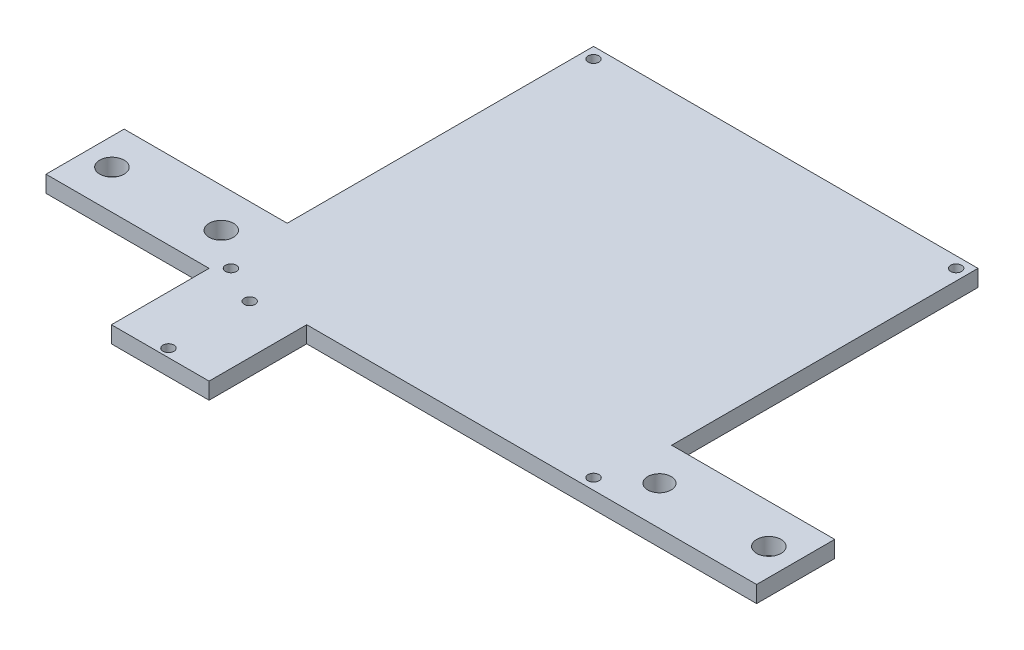
ISO-10303-21;
HEADER;
FILE_DESCRIPTION(('STEP AP214'),'2;1');
FILE_NAME('part.step','',(''),(''),'','','');
FILE_SCHEMA(('AUTOMOTIVE_DESIGN { 1 0 10303 214 1 1 1 1 }'));
ENDSEC;
DATA;
#1=APPLICATION_CONTEXT('core data for automotive mechanical design processes');
#2=APPLICATION_PROTOCOL_DEFINITION('international standard','automotive_design',2000,#1);
#3=PRODUCT_CONTEXT('',#1,'mechanical');
#4=PRODUCT('Part','Part','',(#3));
#5=PRODUCT_RELATED_PRODUCT_CATEGORY('part','',(#4));
#6=PRODUCT_DEFINITION_FORMATION('','',#4);
#7=PRODUCT_DEFINITION_CONTEXT('part definition',#1,'design');
#8=PRODUCT_DEFINITION('design','',#6,#7);
#9=PRODUCT_DEFINITION_SHAPE('','',#8);
#10=(LENGTH_UNIT() NAMED_UNIT(*) SI_UNIT(.MILLI.,.METRE.));
#11=(NAMED_UNIT(*) PLANE_ANGLE_UNIT() SI_UNIT($,.RADIAN.));
#12=(NAMED_UNIT(*) SI_UNIT($,.STERADIAN.) SOLID_ANGLE_UNIT());
#13=UNCERTAINTY_MEASURE_WITH_UNIT(LENGTH_MEASURE(1.E-05),#10,'distance_accuracy_value','');
#14=(GEOMETRIC_REPRESENTATION_CONTEXT(3) GLOBAL_UNCERTAINTY_ASSIGNED_CONTEXT((#13)) GLOBAL_UNIT_ASSIGNED_CONTEXT((#10,
#11,#12)) REPRESENTATION_CONTEXT('',''));
#15=CARTESIAN_POINT('',(0.,0.,0.));
#16=DIRECTION('',(0.,0.,1.));
#17=DIRECTION('',(1.,0.,0.));
#18=AXIS2_PLACEMENT_3D('',#15,#16,#17);
#19=CARTESIAN_POINT('',(0.,4.318,0.));
#20=DIRECTION('',(0.,-1.,0.));
#21=DIRECTION('',(0.,0.,-1.));
#22=AXIS2_PLACEMENT_3D('',#19,#20,#21);
#23=PLANE('',#22);
#24=DIRECTION('',(1.,0.,0.));
#25=VECTOR('',#24,1.);
#26=CARTESIAN_POINT('',(0.,4.318,0.));
#27=LINE('',#26,#25);
#28=CARTESIAN_POINT('',(-42.418,4.318,0.));
#29=VERTEX_POINT('',#28);
#30=CARTESIAN_POINT('',(0.,4.318,0.));
#31=VERTEX_POINT('',#30);
#32=EDGE_CURVE('E178',#29,#31,#27,.T.);
#33=ORIENTED_EDGE('',*,*,#32,.T.);
#34=DIRECTION('',(0.,0.,1.));
#35=VECTOR('',#34,1.);
#36=CARTESIAN_POINT('',(0.,4.318,0.));
#37=LINE('',#36,#35);
#38=CARTESIAN_POINT('',(0.,4.318,25.4));
#39=VERTEX_POINT('',#38);
#40=EDGE_CURVE('E105',#31,#39,#37,.T.);
#41=ORIENTED_EDGE('',*,*,#40,.T.);
#42=DIRECTION('',(1.,0.,0.));
#43=VECTOR('',#42,1.);
#44=CARTESIAN_POINT('',(0.,4.318,25.4));
#45=LINE('',#44,#43);
#46=CARTESIAN_POINT('',(25.4,4.318,25.4));
#47=VERTEX_POINT('',#46);
#48=EDGE_CURVE('E205',#39,#47,#45,.T.);
#49=ORIENTED_EDGE('',*,*,#48,.T.);
#50=DIRECTION('',(0.,0.,-1.));
#51=VECTOR('',#50,1.);
#52=CARTESIAN_POINT('',(25.4,4.318,25.4));
#53=LINE('',#52,#51);
#54=CARTESIAN_POINT('',(25.4,4.318,0.));
#55=VERTEX_POINT('',#54);
#56=EDGE_CURVE('E223',#47,#55,#53,.T.);
#57=ORIENTED_EDGE('',*,*,#56,.T.);
#58=DIRECTION('',(1.,0.,0.));
#59=VECTOR('',#58,1.);
#60=CARTESIAN_POINT('',(25.4,4.318,0.));
#61=LINE('',#60,#59);
#62=CARTESIAN_POINT('',(142.418,4.318,0.));
#63=VERTEX_POINT('',#62);
#64=EDGE_CURVE('E220',#55,#63,#61,.T.);
#65=ORIENTED_EDGE('',*,*,#64,.T.);
#66=DIRECTION('',(0.,0.,-1.));
#67=VECTOR('',#66,1.);
#68=CARTESIAN_POINT('',(142.418,4.318,0.));
#69=LINE('',#68,#67);
#70=CARTESIAN_POINT('',(142.418,4.318,-20.32));
#71=VERTEX_POINT('',#70);
#72=EDGE_CURVE('E222',#63,#71,#69,.T.);
#73=ORIENTED_EDGE('',*,*,#72,.T.);
#74=DIRECTION('',(-1.,0.,0.));
#75=VECTOR('',#74,1.);
#76=CARTESIAN_POINT('',(142.418,4.318,-20.32));
#77=LINE('',#76,#75);
#78=CARTESIAN_POINT('',(100.,4.318,-20.32));
#79=VERTEX_POINT('',#78);
#80=EDGE_CURVE('E225',#71,#79,#77,.T.);
#81=ORIENTED_EDGE('',*,*,#80,.T.);
#82=DIRECTION('',(0.,0.,-1.));
#83=VECTOR('',#82,1.);
#84=CARTESIAN_POINT('',(100.,4.318,-100.));
#85=LINE('',#84,#83);
#86=CARTESIAN_POINT('',(100.,4.318,-100.));
#87=VERTEX_POINT('',#86);
#88=EDGE_CURVE('E231',#79,#87,#85,.T.);
#89=ORIENTED_EDGE('',*,*,#88,.T.);
#90=DIRECTION('',(-1.,0.,0.));
#91=VECTOR('',#90,1.);
#92=CARTESIAN_POINT('',(0.,4.318,-100.));
#93=LINE('',#92,#91);
#94=CARTESIAN_POINT('',(0.,4.318,-100.));
#95=VERTEX_POINT('',#94);
#96=EDGE_CURVE('E136',#87,#95,#93,.T.);
#97=ORIENTED_EDGE('',*,*,#96,.T.);
#98=DIRECTION('',(0.,0.,1.));
#99=VECTOR('',#98,1.);
#100=CARTESIAN_POINT('',(0.,4.318,-20.32));
#101=LINE('',#100,#99);
#102=CARTESIAN_POINT('',(0.,4.318,-20.32));
#103=VERTEX_POINT('',#102);
#104=EDGE_CURVE('E130',#95,#103,#101,.T.);
#105=ORIENTED_EDGE('',*,*,#104,.T.);
#106=DIRECTION('',(-1.,0.,0.));
#107=VECTOR('',#106,1.);
#108=CARTESIAN_POINT('',(-42.418,4.318,-20.32));
#109=LINE('',#108,#107);
#110=CARTESIAN_POINT('',(-42.418,4.318,-20.32));
#111=VERTEX_POINT('',#110);
#112=EDGE_CURVE('E134',#103,#111,#109,.T.);
#113=ORIENTED_EDGE('',*,*,#112,.T.);
#114=DIRECTION('',(0.,0.,1.));
#115=VECTOR('',#114,1.);
#116=CARTESIAN_POINT('',(-42.418,4.318,0.));
#117=LINE('',#116,#115);
#118=EDGE_CURVE('E50',#111,#29,#117,.T.);
#119=ORIENTED_EDGE('',*,*,#118,.T.);
#120=EDGE_LOOP('',(#33,#41,#49,#57,#65,#73,#81,#89,#97,#105,#113,#119));
#121=FACE_BOUND('',#120,.T.);
#122=CARTESIAN_POINT('',(2.84479999999999,4.318,-2.84479999999999));
#123=DIRECTION('',(0.,1.,0.));
#124=DIRECTION('',(0.,0.,1.));
#125=AXIS2_PLACEMENT_3D('',#122,#123,#124);
#126=CIRCLE('',#125,1.4224);
#127=CARTESIAN_POINT('',(2.84479999999999,4.318,-1.42239999999999));
#128=VERTEX_POINT('',#127);
#129=EDGE_CURVE('E158',#128,#128,#126,.T.);
#130=ORIENTED_EDGE('',*,*,#129,.F.);
#131=EDGE_LOOP('',(#130));
#132=FACE_BOUND('',#131,.T.);
#133=CARTESIAN_POINT('',(97.1552,4.318,-2.84479999999999));
#134=DIRECTION('',(0.,1.,0.));
#135=DIRECTION('',(0.,0.,1.));
#136=AXIS2_PLACEMENT_3D('',#133,#134,#135);
#137=CIRCLE('',#136,1.42240000000001);
#138=CARTESIAN_POINT('',(97.1552,4.318,-1.42239999999999));
#139=VERTEX_POINT('',#138);
#140=EDGE_CURVE('E355',#139,#139,#137,.T.);
#141=ORIENTED_EDGE('',*,*,#140,.F.);
#142=EDGE_LOOP('',(#141));
#143=FACE_BOUND('',#142,.T.);
#144=CARTESIAN_POINT('',(2.8448,4.318,-97.1552));
#145=DIRECTION('',(0.,1.,0.));
#146=DIRECTION('',(0.,0.,1.));
#147=AXIS2_PLACEMENT_3D('',#144,#145,#146);
#148=CIRCLE('',#147,1.4224);
#149=CARTESIAN_POINT('',(2.8448,4.318,-95.7328));
#150=VERTEX_POINT('',#149);
#151=EDGE_CURVE('E349',#150,#150,#148,.T.);
#152=ORIENTED_EDGE('',*,*,#151,.F.);
#153=EDGE_LOOP('',(#152));
#154=FACE_BOUND('',#153,.T.);
#155=CARTESIAN_POINT('',(97.1552,4.318,-97.1552));
#156=DIRECTION('',(0.,1.,0.));
#157=DIRECTION('',(0.,0.,1.));
#158=AXIS2_PLACEMENT_3D('',#155,#156,#157);
#159=CIRCLE('',#158,1.42240000000001);
#160=CARTESIAN_POINT('',(97.1552,4.318,-95.7328));
#161=VERTEX_POINT('',#160);
#162=EDGE_CURVE('E343',#161,#161,#159,.T.);
#163=ORIENTED_EDGE('',*,*,#162,.F.);
#164=EDGE_LOOP('',(#163));
#165=FACE_BOUND('',#164,.T.);
#166=CARTESIAN_POINT('',(-6.985,4.318,-10.16));
#167=DIRECTION('',(0.,1.,0.));
#168=DIRECTION('',(0.,0.,1.));
#169=AXIS2_PLACEMENT_3D('',#166,#167,#168);
#170=CIRCLE('',#169,3.175);
#171=CARTESIAN_POINT('',(-6.985,4.318,-6.98499999999999));
#172=VERTEX_POINT('',#171);
#173=EDGE_CURVE('E337',#172,#172,#170,.T.);
#174=ORIENTED_EDGE('',*,*,#173,.F.);
#175=EDGE_LOOP('',(#174));
#176=FACE_BOUND('',#175,.T.);
#177=CARTESIAN_POINT('',(12.7,4.318,23.2664));
#178=DIRECTION('',(0.,1.,0.));
#179=DIRECTION('',(0.,0.,1.));
#180=AXIS2_PLACEMENT_3D('',#177,#178,#179);
#181=CIRCLE('',#180,1.4224);
#182=CARTESIAN_POINT('',(12.7,4.318,24.6888));
#183=VERTEX_POINT('',#182);
#184=EDGE_CURVE('E331',#183,#183,#181,.T.);
#185=ORIENTED_EDGE('',*,*,#184,.F.);
#186=EDGE_LOOP('',(#185));
#187=FACE_BOUND('',#186,.T.);
#188=CARTESIAN_POINT('',(12.7,4.318,2.13360000000001));
#189=DIRECTION('',(0.,1.,0.));
#190=DIRECTION('',(0.,0.,1.));
#191=AXIS2_PLACEMENT_3D('',#188,#189,#190);
#192=CIRCLE('',#191,1.4224);
#193=CARTESIAN_POINT('',(12.7,4.318,3.55600000000001));
#194=VERTEX_POINT('',#193);
#195=EDGE_CURVE('E325',#194,#194,#192,.T.);
#196=ORIENTED_EDGE('',*,*,#195,.F.);
#197=EDGE_LOOP('',(#196));
#198=FACE_BOUND('',#197,.T.);
#199=CARTESIAN_POINT('',(-35.433,4.318,-10.16));
#200=DIRECTION('',(0.,1.,0.));
#201=DIRECTION('',(0.,0.,1.));
#202=AXIS2_PLACEMENT_3D('',#199,#200,#201);
#203=CIRCLE('',#202,3.175);
#204=CARTESIAN_POINT('',(-35.433,4.318,-6.985));
#205=VERTEX_POINT('',#204);
#206=EDGE_CURVE('E319',#205,#205,#203,.T.);
#207=ORIENTED_EDGE('',*,*,#206,.F.);
#208=EDGE_LOOP('',(#207));
#209=FACE_BOUND('',#208,.T.);
#210=CARTESIAN_POINT('',(106.985,4.318,-10.16));
#211=DIRECTION('',(0.,1.,0.));
#212=DIRECTION('',(0.,0.,1.));
#213=AXIS2_PLACEMENT_3D('',#210,#211,#212);
#214=CIRCLE('',#213,3.048);
#215=CARTESIAN_POINT('',(106.985,4.318,-7.112));
#216=VERTEX_POINT('',#215);
#217=EDGE_CURVE('E313',#216,#216,#214,.T.);
#218=ORIENTED_EDGE('',*,*,#217,.F.);
#219=EDGE_LOOP('',(#218));
#220=FACE_BOUND('',#219,.T.);
#221=CARTESIAN_POINT('',(135.433,4.318,-10.16));
#222=DIRECTION('',(0.,1.,0.));
#223=DIRECTION('',(0.,0.,1.));
#224=AXIS2_PLACEMENT_3D('',#221,#222,#223);
#225=CIRCLE('',#224,3.175);
#226=CARTESIAN_POINT('',(135.433,4.318,-6.985));
#227=VERTEX_POINT('',#226);
#228=EDGE_CURVE('E304',#227,#227,#225,.T.);
#229=ORIENTED_EDGE('',*,*,#228,.F.);
#230=EDGE_LOOP('',(#229));
#231=FACE_BOUND('',#230,.T.);
#232=ADVANCED_FACE('F33',(#121,#132,#143,#154,#165,#176,#187,#198,#209,#220,#231),#23,.F.);
#233=CARTESIAN_POINT('',(0.,0.,0.));
#234=DIRECTION('',(0.,-1.,0.));
#235=DIRECTION('',(0.,0.,-1.));
#236=AXIS2_PLACEMENT_3D('',#233,#234,#235);
#237=PLANE('',#236);
#238=CARTESIAN_POINT('',(106.985,0.,-10.16));
#239=DIRECTION('',(0.,1.,0.));
#240=DIRECTION('',(0.,0.,1.));
#241=AXIS2_PLACEMENT_3D('',#238,#239,#240);
#242=CIRCLE('',#241,3.048);
#243=CARTESIAN_POINT('',(106.985,0.,-7.112));
#244=VERTEX_POINT('',#243);
#245=EDGE_CURVE('E310',#244,#244,#242,.T.);
#246=ORIENTED_EDGE('',*,*,#245,.T.);
#247=EDGE_LOOP('',(#246));
#248=FACE_BOUND('',#247,.T.);
#249=CARTESIAN_POINT('',(12.7,0.,2.13360000000001));
#250=DIRECTION('',(0.,1.,0.));
#251=DIRECTION('',(0.,0.,1.));
#252=AXIS2_PLACEMENT_3D('',#249,#250,#251);
#253=CIRCLE('',#252,1.4224);
#254=CARTESIAN_POINT('',(12.7,0.,3.55600000000001));
#255=VERTEX_POINT('',#254);
#256=EDGE_CURVE('E322',#255,#255,#253,.T.);
#257=ORIENTED_EDGE('',*,*,#256,.T.);
#258=EDGE_LOOP('',(#257));
#259=FACE_BOUND('',#258,.T.);
#260=CARTESIAN_POINT('',(-6.985,0.,-10.16));
#261=DIRECTION('',(0.,1.,0.));
#262=DIRECTION('',(0.,0.,1.));
#263=AXIS2_PLACEMENT_3D('',#260,#261,#262);
#264=CIRCLE('',#263,3.175);
#265=CARTESIAN_POINT('',(-6.985,0.,-6.98499999999999));
#266=VERTEX_POINT('',#265);
#267=EDGE_CURVE('E334',#266,#266,#264,.T.);
#268=ORIENTED_EDGE('',*,*,#267,.T.);
#269=EDGE_LOOP('',(#268));
#270=FACE_BOUND('',#269,.T.);
#271=CARTESIAN_POINT('',(2.8448,0.,-97.1552));
#272=DIRECTION('',(0.,1.,0.));
#273=DIRECTION('',(0.,0.,1.));
#274=AXIS2_PLACEMENT_3D('',#271,#272,#273);
#275=CIRCLE('',#274,1.4224);
#276=CARTESIAN_POINT('',(2.8448,0.,-95.7328));
#277=VERTEX_POINT('',#276);
#278=EDGE_CURVE('E346',#277,#277,#275,.T.);
#279=ORIENTED_EDGE('',*,*,#278,.T.);
#280=EDGE_LOOP('',(#279));
#281=FACE_BOUND('',#280,.T.);
#282=CARTESIAN_POINT('',(2.84479999999999,0.,-2.84479999999999));
#283=DIRECTION('',(0.,1.,0.));
#284=DIRECTION('',(0.,0.,1.));
#285=AXIS2_PLACEMENT_3D('',#282,#283,#284);
#286=CIRCLE('',#285,1.4224);
#287=CARTESIAN_POINT('',(2.84479999999999,0.,-1.42239999999999));
#288=VERTEX_POINT('',#287);
#289=EDGE_CURVE('E358',#288,#288,#286,.T.);
#290=ORIENTED_EDGE('',*,*,#289,.T.);
#291=EDGE_LOOP('',(#290));
#292=FACE_BOUND('',#291,.T.);
#293=DIRECTION('',(1.,0.,0.));
#294=VECTOR('',#293,1.);
#295=CARTESIAN_POINT('',(0.,0.,0.));
#296=LINE('',#295,#294);
#297=CARTESIAN_POINT('',(-42.418,0.,0.));
#298=VERTEX_POINT('',#297);
#299=CARTESIAN_POINT('',(0.,0.,0.));
#300=VERTEX_POINT('',#299);
#301=EDGE_CURVE('E154',#298,#300,#296,.T.);
#302=ORIENTED_EDGE('',*,*,#301,.F.);
#303=DIRECTION('',(0.,0.,1.));
#304=VECTOR('',#303,1.);
#305=CARTESIAN_POINT('',(-42.418,0.,0.));
#306=LINE('',#305,#304);
#307=CARTESIAN_POINT('',(-42.418,0.,-20.32));
#308=VERTEX_POINT('',#307);
#309=EDGE_CURVE('E97',#308,#298,#306,.T.);
#310=ORIENTED_EDGE('',*,*,#309,.F.);
#311=DIRECTION('',(-1.,0.,0.));
#312=VECTOR('',#311,1.);
#313=CARTESIAN_POINT('',(-42.418,0.,-20.32));
#314=LINE('',#313,#312);
#315=CARTESIAN_POINT('',(0.,0.,-20.32));
#316=VERTEX_POINT('',#315);
#317=EDGE_CURVE('E91',#316,#308,#314,.T.);
#318=ORIENTED_EDGE('',*,*,#317,.F.);
#319=DIRECTION('',(0.,0.,1.));
#320=VECTOR('',#319,1.);
#321=CARTESIAN_POINT('',(0.,0.,-20.32));
#322=LINE('',#321,#320);
#323=CARTESIAN_POINT('',(0.,0.,-100.));
#324=VERTEX_POINT('',#323);
#325=EDGE_CURVE('E144',#324,#316,#322,.T.);
#326=ORIENTED_EDGE('',*,*,#325,.F.);
#327=DIRECTION('',(-1.,0.,0.));
#328=VECTOR('',#327,1.);
#329=CARTESIAN_POINT('',(0.,0.,-100.));
#330=LINE('',#329,#328);
#331=CARTESIAN_POINT('',(100.,0.,-100.));
#332=VERTEX_POINT('',#331);
#333=EDGE_CURVE('E173',#332,#324,#330,.T.);
#334=ORIENTED_EDGE('',*,*,#333,.F.);
#335=DIRECTION('',(0.,0.,-1.));
#336=VECTOR('',#335,1.);
#337=CARTESIAN_POINT('',(100.,0.,-100.));
#338=LINE('',#337,#336);
#339=CARTESIAN_POINT('',(100.,0.,-20.32));
#340=VERTEX_POINT('',#339);
#341=EDGE_CURVE('E171',#340,#332,#338,.T.);
#342=ORIENTED_EDGE('',*,*,#341,.F.);
#343=DIRECTION('',(-1.,0.,0.));
#344=VECTOR('',#343,1.);
#345=CARTESIAN_POINT('',(142.418,0.,-20.32));
#346=LINE('',#345,#344);
#347=CARTESIAN_POINT('',(142.418,0.,-20.32));
#348=VERTEX_POINT('',#347);
#349=EDGE_CURVE('E169',#348,#340,#346,.T.);
#350=ORIENTED_EDGE('',*,*,#349,.F.);
#351=DIRECTION('',(0.,0.,-1.));
#352=VECTOR('',#351,1.);
#353=CARTESIAN_POINT('',(142.418,0.,0.));
#354=LINE('',#353,#352);
#355=CARTESIAN_POINT('',(142.418,0.,0.));
#356=VERTEX_POINT('',#355);
#357=EDGE_CURVE('E167',#356,#348,#354,.T.);
#358=ORIENTED_EDGE('',*,*,#357,.F.);
#359=DIRECTION('',(1.,0.,0.));
#360=VECTOR('',#359,1.);
#361=CARTESIAN_POINT('',(100.,0.,0.));
#362=LINE('',#361,#360);
#363=CARTESIAN_POINT('',(25.4,0.,0.));
#364=VERTEX_POINT('',#363);
#365=EDGE_CURVE('E165',#364,#356,#362,.T.);
#366=ORIENTED_EDGE('',*,*,#365,.F.);
#367=DIRECTION('',(0.,0.,-1.));
#368=VECTOR('',#367,1.);
#369=CARTESIAN_POINT('',(25.4,0.,25.4));
#370=LINE('',#369,#368);
#371=CARTESIAN_POINT('',(25.4,0.,25.4));
#372=VERTEX_POINT('',#371);
#373=EDGE_CURVE('E162',#372,#364,#370,.T.);
#374=ORIENTED_EDGE('',*,*,#373,.F.);
#375=DIRECTION('',(1.,0.,0.));
#376=VECTOR('',#375,1.);
#377=CARTESIAN_POINT('',(0.,0.,25.4));
#378=LINE('',#377,#376);
#379=CARTESIAN_POINT('',(0.,0.,25.4));
#380=VERTEX_POINT('',#379);
#381=EDGE_CURVE('E160',#380,#372,#378,.T.);
#382=ORIENTED_EDGE('',*,*,#381,.F.);
#383=DIRECTION('',(0.,0.,1.));
#384=VECTOR('',#383,1.);
#385=CARTESIAN_POINT('',(0.,0.,0.));
#386=LINE('',#385,#384);
#387=EDGE_CURVE('E157',#300,#380,#386,.T.);
#388=ORIENTED_EDGE('',*,*,#387,.F.);
#389=EDGE_LOOP('',(#302,#310,#318,#326,#334,#342,#350,#358,#366,#374,#382,#388));
#390=FACE_BOUND('',#389,.T.);
#391=CARTESIAN_POINT('',(97.1552,0.,-2.84479999999999));
#392=DIRECTION('',(0.,1.,0.));
#393=DIRECTION('',(0.,0.,1.));
#394=AXIS2_PLACEMENT_3D('',#391,#392,#393);
#395=CIRCLE('',#394,1.42240000000001);
#396=CARTESIAN_POINT('',(97.1552,0.,-1.42239999999999));
#397=VERTEX_POINT('',#396);
#398=EDGE_CURVE('E352',#397,#397,#395,.T.);
#399=ORIENTED_EDGE('',*,*,#398,.T.);
#400=EDGE_LOOP('',(#399));
#401=FACE_BOUND('',#400,.T.);
#402=CARTESIAN_POINT('',(97.1552,0.,-97.1552));
#403=DIRECTION('',(0.,1.,0.));
#404=DIRECTION('',(0.,0.,1.));
#405=AXIS2_PLACEMENT_3D('',#402,#403,#404);
#406=CIRCLE('',#405,1.42240000000001);
#407=CARTESIAN_POINT('',(97.1552,0.,-95.7328));
#408=VERTEX_POINT('',#407);
#409=EDGE_CURVE('E340',#408,#408,#406,.T.);
#410=ORIENTED_EDGE('',*,*,#409,.T.);
#411=EDGE_LOOP('',(#410));
#412=FACE_BOUND('',#411,.T.);
#413=CARTESIAN_POINT('',(12.7,0.,23.2664));
#414=DIRECTION('',(0.,1.,0.));
#415=DIRECTION('',(0.,0.,1.));
#416=AXIS2_PLACEMENT_3D('',#413,#414,#415);
#417=CIRCLE('',#416,1.4224);
#418=CARTESIAN_POINT('',(12.7,0.,24.6888));
#419=VERTEX_POINT('',#418);
#420=EDGE_CURVE('E328',#419,#419,#417,.T.);
#421=ORIENTED_EDGE('',*,*,#420,.T.);
#422=EDGE_LOOP('',(#421));
#423=FACE_BOUND('',#422,.T.);
#424=CARTESIAN_POINT('',(-35.433,0.,-10.16));
#425=DIRECTION('',(0.,1.,0.));
#426=DIRECTION('',(0.,0.,1.));
#427=AXIS2_PLACEMENT_3D('',#424,#425,#426);
#428=CIRCLE('',#427,3.175);
#429=CARTESIAN_POINT('',(-35.433,0.,-6.985));
#430=VERTEX_POINT('',#429);
#431=EDGE_CURVE('E316',#430,#430,#428,.T.);
#432=ORIENTED_EDGE('',*,*,#431,.T.);
#433=EDGE_LOOP('',(#432));
#434=FACE_BOUND('',#433,.T.);
#435=CARTESIAN_POINT('',(135.433,0.,-10.16));
#436=DIRECTION('',(0.,1.,0.));
#437=DIRECTION('',(0.,0.,1.));
#438=AXIS2_PLACEMENT_3D('',#435,#436,#437);
#439=CIRCLE('',#438,3.175);
#440=CARTESIAN_POINT('',(135.433,0.,-6.985));
#441=VERTEX_POINT('',#440);
#442=EDGE_CURVE('E307',#441,#441,#439,.T.);
#443=ORIENTED_EDGE('',*,*,#442,.T.);
#444=EDGE_LOOP('',(#443));
#445=FACE_BOUND('',#444,.T.);
#446=ADVANCED_FACE('F209',(#248,#259,#270,#281,#292,#390,#401,#412,#423,#434,#445),#237,.T.);
#447=CARTESIAN_POINT('',(0.,4.318,0.));
#448=DIRECTION('',(0.,0.,-1.));
#449=DIRECTION('',(-1.,0.,0.));
#450=AXIS2_PLACEMENT_3D('',#447,#448,#449);
#451=PLANE('',#450);
#452=ORIENTED_EDGE('',*,*,#301,.T.);
#453=DIRECTION('',(0.,-1.,0.));
#454=VECTOR('',#453,1.);
#455=CARTESIAN_POINT('',(0.,4.318,0.));
#456=LINE('',#455,#454);
#457=EDGE_CURVE('E11',#31,#300,#456,.T.);
#458=ORIENTED_EDGE('',*,*,#457,.F.);
#459=ORIENTED_EDGE('',*,*,#32,.F.);
#460=DIRECTION('',(0.,-1.,0.));
#461=VECTOR('',#460,1.);
#462=CARTESIAN_POINT('',(-42.418,4.318,0.));
#463=LINE('',#462,#461);
#464=EDGE_CURVE('E150',#29,#298,#463,.T.);
#465=ORIENTED_EDGE('',*,*,#464,.T.);
#466=EDGE_LOOP('',(#452,#458,#459,#465));
#467=FACE_BOUND('',#466,.T.);
#468=ADVANCED_FACE('F35',(#467),#451,.F.);
#469=CARTESIAN_POINT('',(0.,4.318,0.));
#470=DIRECTION('',(1.,0.,0.));
#471=DIRECTION('',(0.,0.,-1.));
#472=AXIS2_PLACEMENT_3D('',#469,#470,#471);
#473=PLANE('',#472);
#474=ORIENTED_EDGE('',*,*,#387,.T.);
#475=DIRECTION('',(0.,-1.,0.));
#476=VECTOR('',#475,1.);
#477=CARTESIAN_POINT('',(0.,4.318,25.4));
#478=LINE('',#477,#476);
#479=EDGE_CURVE('E42',#39,#380,#478,.T.);
#480=ORIENTED_EDGE('',*,*,#479,.F.);
#481=ORIENTED_EDGE('',*,*,#40,.F.);
#482=ORIENTED_EDGE('',*,*,#457,.T.);
#483=EDGE_LOOP('',(#474,#480,#481,#482));
#484=FACE_BOUND('',#483,.T.);
#485=ADVANCED_FACE('F525',(#484),#473,.F.);
#486=CARTESIAN_POINT('',(0.,4.318,25.4));
#487=DIRECTION('',(0.,0.,-1.));
#488=DIRECTION('',(-1.,0.,0.));
#489=AXIS2_PLACEMENT_3D('',#486,#487,#488);
#490=PLANE('',#489);
#491=ORIENTED_EDGE('',*,*,#381,.T.);
#492=DIRECTION('',(0.,-1.,0.));
#493=VECTOR('',#492,1.);
#494=CARTESIAN_POINT('',(25.4,4.318,25.4));
#495=LINE('',#494,#493);
#496=EDGE_CURVE('E197',#47,#372,#495,.T.);
#497=ORIENTED_EDGE('',*,*,#496,.F.);
#498=ORIENTED_EDGE('',*,*,#48,.F.);
#499=ORIENTED_EDGE('',*,*,#479,.T.);
#500=EDGE_LOOP('',(#491,#497,#498,#499));
#501=FACE_BOUND('',#500,.T.);
#502=ADVANCED_FACE('F203',(#501),#490,.F.);
#503=CARTESIAN_POINT('',(25.4,4.318,25.4));
#504=DIRECTION('',(-1.,0.,0.));
#505=DIRECTION('',(0.,0.,1.));
#506=AXIS2_PLACEMENT_3D('',#503,#504,#505);
#507=PLANE('',#506);
#508=ORIENTED_EDGE('',*,*,#373,.T.);
#509=DIRECTION('',(0.,-1.,0.));
#510=VECTOR('',#509,1.);
#511=CARTESIAN_POINT('',(25.4,4.318,0.));
#512=LINE('',#511,#510);
#513=EDGE_CURVE('E194',#55,#364,#512,.T.);
#514=ORIENTED_EDGE('',*,*,#513,.F.);
#515=ORIENTED_EDGE('',*,*,#56,.F.);
#516=ORIENTED_EDGE('',*,*,#496,.T.);
#517=EDGE_LOOP('',(#508,#514,#515,#516));
#518=FACE_BOUND('',#517,.T.);
#519=ADVANCED_FACE('F214',(#518),#507,.F.);
#520=CARTESIAN_POINT('',(100.,4.318,0.));
#521=DIRECTION('',(0.,0.,-1.));
#522=DIRECTION('',(-1.,0.,0.));
#523=AXIS2_PLACEMENT_3D('',#520,#521,#522);
#524=PLANE('',#523);
#525=ORIENTED_EDGE('',*,*,#365,.T.);
#526=DIRECTION('',(0.,-1.,0.));
#527=VECTOR('',#526,1.);
#528=CARTESIAN_POINT('',(142.418,4.318,0.));
#529=LINE('',#528,#527);
#530=EDGE_CURVE('E191',#63,#356,#529,.T.);
#531=ORIENTED_EDGE('',*,*,#530,.F.);
#532=ORIENTED_EDGE('',*,*,#64,.F.);
#533=ORIENTED_EDGE('',*,*,#513,.T.);
#534=EDGE_LOOP('',(#525,#531,#532,#533));
#535=FACE_BOUND('',#534,.T.);
#536=ADVANCED_FACE('F218',(#535),#524,.F.);
#537=CARTESIAN_POINT('',(142.418,4.318,0.));
#538=DIRECTION('',(-1.,0.,0.));
#539=DIRECTION('',(0.,0.,1.));
#540=AXIS2_PLACEMENT_3D('',#537,#538,#539);
#541=PLANE('',#540);
#542=ORIENTED_EDGE('',*,*,#357,.T.);
#543=DIRECTION('',(0.,-1.,0.));
#544=VECTOR('',#543,1.);
#545=CARTESIAN_POINT('',(142.418,4.318,-20.32));
#546=LINE('',#545,#544);
#547=EDGE_CURVE('E188',#71,#348,#546,.T.);
#548=ORIENTED_EDGE('',*,*,#547,.F.);
#549=ORIENTED_EDGE('',*,*,#72,.F.);
#550=ORIENTED_EDGE('',*,*,#530,.T.);
#551=EDGE_LOOP('',(#542,#548,#549,#550));
#552=FACE_BOUND('',#551,.T.);
#553=ADVANCED_FACE('F489',(#552),#541,.F.);
#554=CARTESIAN_POINT('',(142.418,4.318,-20.32));
#555=DIRECTION('',(0.,0.,1.));
#556=DIRECTION('',(1.,0.,0.));
#557=AXIS2_PLACEMENT_3D('',#554,#555,#556);
#558=PLANE('',#557);
#559=ORIENTED_EDGE('',*,*,#349,.T.);
#560=DIRECTION('',(0.,-1.,0.));
#561=VECTOR('',#560,1.);
#562=CARTESIAN_POINT('',(100.,4.318,-20.32));
#563=LINE('',#562,#561);
#564=EDGE_CURVE('E185',#79,#340,#563,.T.);
#565=ORIENTED_EDGE('',*,*,#564,.F.);
#566=ORIENTED_EDGE('',*,*,#80,.F.);
#567=ORIENTED_EDGE('',*,*,#547,.T.);
#568=EDGE_LOOP('',(#559,#565,#566,#567));
#569=FACE_BOUND('',#568,.T.);
#570=ADVANCED_FACE('F480',(#569),#558,.F.);
#571=CARTESIAN_POINT('',(100.,4.318,-100.));
#572=DIRECTION('',(-1.,0.,0.));
#573=DIRECTION('',(0.,0.,1.));
#574=AXIS2_PLACEMENT_3D('',#571,#572,#573);
#575=PLANE('',#574);
#576=ORIENTED_EDGE('',*,*,#341,.T.);
#577=DIRECTION('',(0.,-1.,0.));
#578=VECTOR('',#577,1.);
#579=CARTESIAN_POINT('',(100.,4.318,-100.));
#580=LINE('',#579,#578);
#581=EDGE_CURVE('E182',#87,#332,#580,.T.);
#582=ORIENTED_EDGE('',*,*,#581,.F.);
#583=ORIENTED_EDGE('',*,*,#88,.F.);
#584=ORIENTED_EDGE('',*,*,#564,.T.);
#585=EDGE_LOOP('',(#576,#582,#583,#584));
#586=FACE_BOUND('',#585,.T.);
#587=ADVANCED_FACE('F237',(#586),#575,.F.);
#588=CARTESIAN_POINT('',(0.,4.318,-100.));
#589=DIRECTION('',(0.,0.,1.));
#590=DIRECTION('',(1.,0.,0.));
#591=AXIS2_PLACEMENT_3D('',#588,#589,#590);
#592=PLANE('',#591);
#593=ORIENTED_EDGE('',*,*,#333,.T.);
#594=DIRECTION('',(0.,-1.,0.));
#595=VECTOR('',#594,1.);
#596=CARTESIAN_POINT('',(0.,4.318,-100.));
#597=LINE('',#596,#595);
#598=EDGE_CURVE('E145',#95,#324,#597,.T.);
#599=ORIENTED_EDGE('',*,*,#598,.F.);
#600=ORIENTED_EDGE('',*,*,#96,.F.);
#601=ORIENTED_EDGE('',*,*,#581,.T.);
#602=EDGE_LOOP('',(#593,#599,#600,#601));
#603=FACE_BOUND('',#602,.T.);
#604=ADVANCED_FACE('F241',(#603),#592,.F.);
#605=CARTESIAN_POINT('',(0.,4.318,-20.32));
#606=DIRECTION('',(1.,0.,0.));
#607=DIRECTION('',(0.,0.,-1.));
#608=AXIS2_PLACEMENT_3D('',#605,#606,#607);
#609=PLANE('',#608);
#610=ORIENTED_EDGE('',*,*,#325,.T.);
#611=DIRECTION('',(0.,-1.,0.));
#612=VECTOR('',#611,1.);
#613=CARTESIAN_POINT('',(0.,4.318,-20.32));
#614=LINE('',#613,#612);
#615=EDGE_CURVE('E141',#103,#316,#614,.T.);
#616=ORIENTED_EDGE('',*,*,#615,.F.);
#617=ORIENTED_EDGE('',*,*,#104,.F.);
#618=ORIENTED_EDGE('',*,*,#598,.T.);
#619=EDGE_LOOP('',(#610,#616,#617,#618));
#620=FACE_BOUND('',#619,.T.);
#621=ADVANCED_FACE('F142',(#620),#609,.F.);
#622=CARTESIAN_POINT('',(-42.418,4.318,-20.32));
#623=DIRECTION('',(0.,0.,1.));
#624=DIRECTION('',(1.,0.,0.));
#625=AXIS2_PLACEMENT_3D('',#622,#623,#624);
#626=PLANE('',#625);
#627=ORIENTED_EDGE('',*,*,#317,.T.);
#628=DIRECTION('',(0.,-1.,0.));
#629=VECTOR('',#628,1.);
#630=CARTESIAN_POINT('',(-42.418,4.318,-20.32));
#631=LINE('',#630,#629);
#632=EDGE_CURVE('E146',#111,#308,#631,.T.);
#633=ORIENTED_EDGE('',*,*,#632,.F.);
#634=ORIENTED_EDGE('',*,*,#112,.F.);
#635=ORIENTED_EDGE('',*,*,#615,.T.);
#636=EDGE_LOOP('',(#627,#633,#634,#635));
#637=FACE_BOUND('',#636,.T.);
#638=ADVANCED_FACE('F148',(#637),#626,.F.);
#639=CARTESIAN_POINT('',(-42.418,4.318,0.));
#640=DIRECTION('',(1.,0.,0.));
#641=DIRECTION('',(0.,0.,-1.));
#642=AXIS2_PLACEMENT_3D('',#639,#640,#641);
#643=PLANE('',#642);
#644=ORIENTED_EDGE('',*,*,#309,.T.);
#645=ORIENTED_EDGE('',*,*,#464,.F.);
#646=ORIENTED_EDGE('',*,*,#118,.F.);
#647=ORIENTED_EDGE('',*,*,#632,.T.);
#648=EDGE_LOOP('',(#644,#645,#646,#647));
#649=FACE_BOUND('',#648,.T.);
#650=ADVANCED_FACE('F245',(#649),#643,.F.);
#651=CARTESIAN_POINT('',(2.84479999999999,4.318,-2.84479999999999));
#652=DIRECTION('',(0.,-1.,0.));
#653=DIRECTION('',(0.,0.,-1.));
#654=AXIS2_PLACEMENT_3D('',#651,#652,#653);
#655=CYLINDRICAL_SURFACE('',#654,1.4224);
#656=ORIENTED_EDGE('',*,*,#129,.T.);
#657=EDGE_LOOP('',(#656));
#658=FACE_BOUND('',#657,.T.);
#659=ORIENTED_EDGE('',*,*,#289,.F.);
#660=EDGE_LOOP('',(#659));
#661=FACE_BOUND('',#660,.T.);
#662=ADVANCED_FACE('F247',(#658,#661),#655,.F.);
#663=CARTESIAN_POINT('',(97.1552,4.318,-2.84479999999999));
#664=DIRECTION('',(0.,-1.,0.));
#665=DIRECTION('',(0.,0.,-1.));
#666=AXIS2_PLACEMENT_3D('',#663,#664,#665);
#667=CYLINDRICAL_SURFACE('',#666,1.42240000000001);
#668=ORIENTED_EDGE('',*,*,#140,.T.);
#669=EDGE_LOOP('',(#668));
#670=FACE_BOUND('',#669,.T.);
#671=ORIENTED_EDGE('',*,*,#398,.F.);
#672=EDGE_LOOP('',(#671));
#673=FACE_BOUND('',#672,.T.);
#674=ADVANCED_FACE('F253',(#670,#673),#667,.F.);
#675=CARTESIAN_POINT('',(2.8448,4.318,-97.1552));
#676=DIRECTION('',(0.,-1.,0.));
#677=DIRECTION('',(0.,0.,-1.));
#678=AXIS2_PLACEMENT_3D('',#675,#676,#677);
#679=CYLINDRICAL_SURFACE('',#678,1.4224);
#680=ORIENTED_EDGE('',*,*,#151,.T.);
#681=EDGE_LOOP('',(#680));
#682=FACE_BOUND('',#681,.T.);
#683=ORIENTED_EDGE('',*,*,#278,.F.);
#684=EDGE_LOOP('',(#683));
#685=FACE_BOUND('',#684,.T.);
#686=ADVANCED_FACE('F267',(#682,#685),#679,.F.);
#687=CARTESIAN_POINT('',(97.1552,4.318,-97.1552));
#688=DIRECTION('',(0.,-1.,0.));
#689=DIRECTION('',(0.,0.,-1.));
#690=AXIS2_PLACEMENT_3D('',#687,#688,#689);
#691=CYLINDRICAL_SURFACE('',#690,1.42240000000001);
#692=ORIENTED_EDGE('',*,*,#162,.T.);
#693=EDGE_LOOP('',(#692));
#694=FACE_BOUND('',#693,.T.);
#695=ORIENTED_EDGE('',*,*,#409,.F.);
#696=EDGE_LOOP('',(#695));
#697=FACE_BOUND('',#696,.T.);
#698=ADVANCED_FACE('F271',(#694,#697),#691,.F.);
#699=CARTESIAN_POINT('',(-6.985,4.318,-10.16));
#700=DIRECTION('',(0.,-1.,0.));
#701=DIRECTION('',(0.,0.,-1.));
#702=AXIS2_PLACEMENT_3D('',#699,#700,#701);
#703=CYLINDRICAL_SURFACE('',#702,3.175);
#704=ORIENTED_EDGE('',*,*,#173,.T.);
#705=EDGE_LOOP('',(#704));
#706=FACE_BOUND('',#705,.T.);
#707=ORIENTED_EDGE('',*,*,#267,.F.);
#708=EDGE_LOOP('',(#707));
#709=FACE_BOUND('',#708,.T.);
#710=ADVANCED_FACE('F275',(#706,#709),#703,.F.);
#711=CARTESIAN_POINT('',(12.7,4.318,23.2664));
#712=DIRECTION('',(0.,-1.,0.));
#713=DIRECTION('',(0.,0.,-1.));
#714=AXIS2_PLACEMENT_3D('',#711,#712,#713);
#715=CYLINDRICAL_SURFACE('',#714,1.4224);
#716=ORIENTED_EDGE('',*,*,#184,.T.);
#717=EDGE_LOOP('',(#716));
#718=FACE_BOUND('',#717,.T.);
#719=ORIENTED_EDGE('',*,*,#420,.F.);
#720=EDGE_LOOP('',(#719));
#721=FACE_BOUND('',#720,.T.);
#722=ADVANCED_FACE('F279',(#718,#721),#715,.F.);
#723=CARTESIAN_POINT('',(12.7,4.318,2.13360000000001));
#724=DIRECTION('',(0.,-1.,0.));
#725=DIRECTION('',(0.,0.,-1.));
#726=AXIS2_PLACEMENT_3D('',#723,#724,#725);
#727=CYLINDRICAL_SURFACE('',#726,1.4224);
#728=ORIENTED_EDGE('',*,*,#195,.T.);
#729=EDGE_LOOP('',(#728));
#730=FACE_BOUND('',#729,.T.);
#731=ORIENTED_EDGE('',*,*,#256,.F.);
#732=EDGE_LOOP('',(#731));
#733=FACE_BOUND('',#732,.T.);
#734=ADVANCED_FACE('F283',(#730,#733),#727,.F.);
#735=CARTESIAN_POINT('',(-35.433,4.318,-10.16));
#736=DIRECTION('',(0.,-1.,0.));
#737=DIRECTION('',(0.,0.,-1.));
#738=AXIS2_PLACEMENT_3D('',#735,#736,#737);
#739=CYLINDRICAL_SURFACE('',#738,3.175);
#740=ORIENTED_EDGE('',*,*,#206,.T.);
#741=EDGE_LOOP('',(#740));
#742=FACE_BOUND('',#741,.T.);
#743=ORIENTED_EDGE('',*,*,#431,.F.);
#744=EDGE_LOOP('',(#743));
#745=FACE_BOUND('',#744,.T.);
#746=ADVANCED_FACE('F287',(#742,#745),#739,.F.);
#747=CARTESIAN_POINT('',(106.985,4.318,-10.16));
#748=DIRECTION('',(0.,-1.,0.));
#749=DIRECTION('',(0.,0.,-1.));
#750=AXIS2_PLACEMENT_3D('',#747,#748,#749);
#751=CYLINDRICAL_SURFACE('',#750,3.048);
#752=ORIENTED_EDGE('',*,*,#217,.T.);
#753=EDGE_LOOP('',(#752));
#754=FACE_BOUND('',#753,.T.);
#755=ORIENTED_EDGE('',*,*,#245,.F.);
#756=EDGE_LOOP('',(#755));
#757=FACE_BOUND('',#756,.T.);
#758=ADVANCED_FACE('F291',(#754,#757),#751,.F.);
#759=CARTESIAN_POINT('',(135.433,4.318,-10.16));
#760=DIRECTION('',(0.,-1.,0.));
#761=DIRECTION('',(0.,0.,-1.));
#762=AXIS2_PLACEMENT_3D('',#759,#760,#761);
#763=CYLINDRICAL_SURFACE('',#762,3.175);
#764=ORIENTED_EDGE('',*,*,#228,.T.);
#765=EDGE_LOOP('',(#764));
#766=FACE_BOUND('',#765,.T.);
#767=ORIENTED_EDGE('',*,*,#442,.F.);
#768=EDGE_LOOP('',(#767));
#769=FACE_BOUND('',#768,.T.);
#770=ADVANCED_FACE('F295',(#766,#769),#763,.F.);
#771=CLOSED_SHELL('',(#232,#446,#468,#485,#502,#519,#536,#553,#570,#587,#604,#621,#638,#650,
#662,#674,#686,#698,#710,#722,#734,#746,#758,#770));
#772=MANIFOLD_SOLID_BREP('B2',#771);
#773=ADVANCED_BREP_SHAPE_REPRESENTATION('',(#18,#772),#14);
#774=SHAPE_DEFINITION_REPRESENTATION(#9,#773);
ENDSEC;
END-ISO-10303-21;
